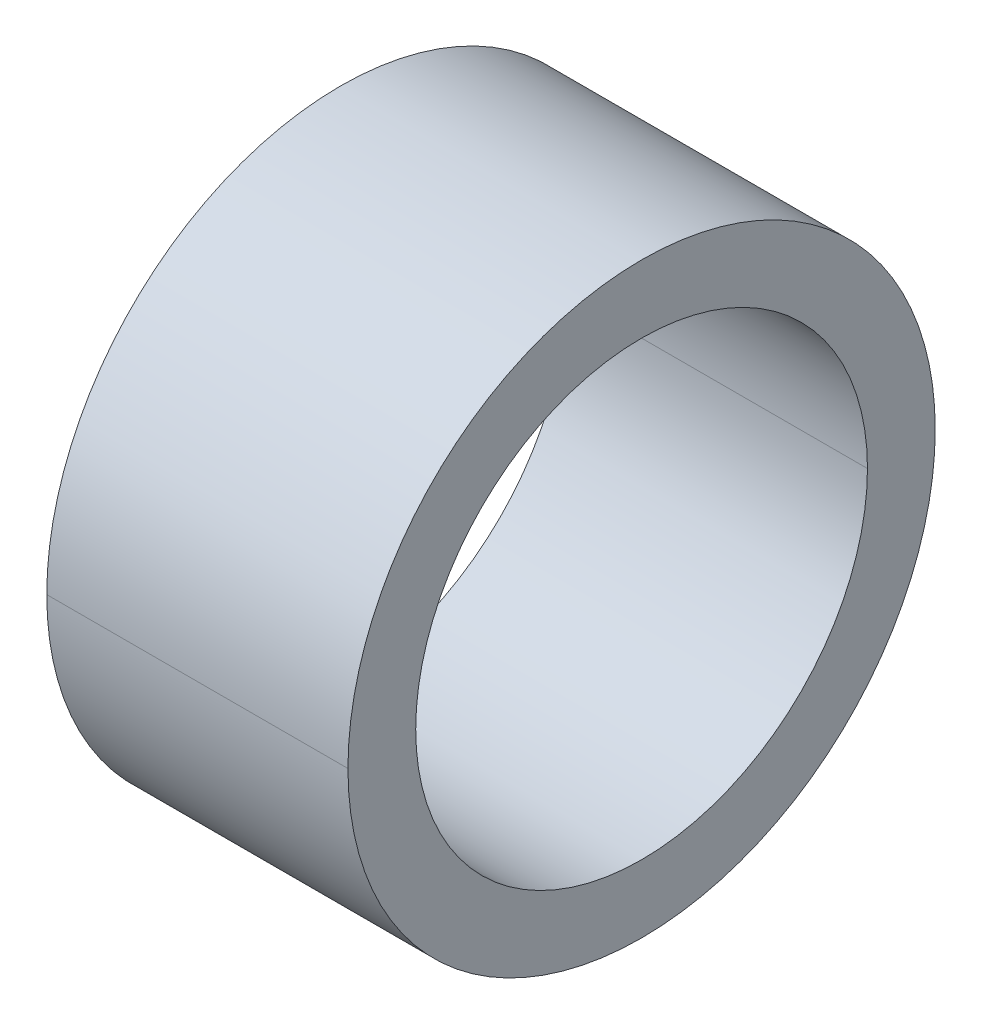
ISO-10303-21;
HEADER;
FILE_DESCRIPTION(('STEP AP214'),'2;1');
FILE_NAME('part.step','',(''),(''),'','','');
FILE_SCHEMA(('AUTOMOTIVE_DESIGN { 1 0 10303 214 1 1 1 1 }'));
ENDSEC;
DATA;
#1=APPLICATION_CONTEXT('core data for automotive mechanical design processes');
#2=APPLICATION_PROTOCOL_DEFINITION('international standard','automotive_design',2000,#1);
#3=PRODUCT_CONTEXT('',#1,'mechanical');
#4=PRODUCT('Part','Part','',(#3));
#5=PRODUCT_RELATED_PRODUCT_CATEGORY('part','',(#4));
#6=PRODUCT_DEFINITION_FORMATION('','',#4);
#7=PRODUCT_DEFINITION_CONTEXT('part definition',#1,'design');
#8=PRODUCT_DEFINITION('design','',#6,#7);
#9=PRODUCT_DEFINITION_SHAPE('','',#8);
#10=(LENGTH_UNIT() NAMED_UNIT(*) SI_UNIT(.MILLI.,.METRE.));
#11=(NAMED_UNIT(*) PLANE_ANGLE_UNIT() SI_UNIT($,.RADIAN.));
#12=(NAMED_UNIT(*) SI_UNIT($,.STERADIAN.) SOLID_ANGLE_UNIT());
#13=UNCERTAINTY_MEASURE_WITH_UNIT(LENGTH_MEASURE(1.E-05),#10,'distance_accuracy_value','');
#14=(GEOMETRIC_REPRESENTATION_CONTEXT(3) GLOBAL_UNCERTAINTY_ASSIGNED_CONTEXT((#13)) GLOBAL_UNIT_ASSIGNED_CONTEXT((#10,
#11,#12)) REPRESENTATION_CONTEXT('',''));
#15=CARTESIAN_POINT('',(0.,0.,0.));
#16=DIRECTION('',(0.,0.,1.));
#17=DIRECTION('',(1.,0.,0.));
#18=AXIS2_PLACEMENT_3D('',#15,#16,#17);
#19=CARTESIAN_POINT('',(0.,9.75,0.));
#20=DIRECTION('',(-1.,0.,0.));
#21=DIRECTION('',(0.,0.,1.));
#22=AXIS2_PLACEMENT_3D('',#19,#20,#21);
#23=PLANE('',#22);
#24=CARTESIAN_POINT('',(0.,0.,0.));
#25=DIRECTION('',(1.,0.,0.));
#26=DIRECTION('',(0.,0.,-1.));
#27=AXIS2_PLACEMENT_3D('',#24,#25,#26);
#28=CIRCLE('',#27,7.5);
#29=CARTESIAN_POINT('',(0.,0.,-7.5));
#30=VERTEX_POINT('',#29);
#31=CARTESIAN_POINT('',(0.,0.,7.5));
#32=VERTEX_POINT('',#31);
#33=EDGE_CURVE('E11',#30,#32,#28,.T.);
#34=ORIENTED_EDGE('',*,*,#33,.T.);
#35=CARTESIAN_POINT('',(0.,0.,0.));
#36=DIRECTION('',(1.,0.,0.));
#37=DIRECTION('',(0.,0.,-1.));
#38=AXIS2_PLACEMENT_3D('',#35,#36,#37);
#39=CIRCLE('',#38,7.5);
#40=EDGE_CURVE('E25',#32,#30,#39,.T.);
#41=ORIENTED_EDGE('',*,*,#40,.T.);
#42=EDGE_LOOP('',(#34,#41));
#43=FACE_BOUND('',#42,.T.);
#44=CARTESIAN_POINT('',(0.,0.,0.));
#45=DIRECTION('',(1.,0.,0.));
#46=DIRECTION('',(0.,0.,-1.));
#47=AXIS2_PLACEMENT_3D('',#44,#45,#46);
#48=CIRCLE('',#47,9.75);
#49=CARTESIAN_POINT('',(0.,0.,9.75));
#50=VERTEX_POINT('',#49);
#51=CARTESIAN_POINT('',(0.,0.,-9.75));
#52=VERTEX_POINT('',#51);
#53=EDGE_CURVE('E95',#50,#52,#48,.T.);
#54=ORIENTED_EDGE('',*,*,#53,.F.);
#55=CARTESIAN_POINT('',(0.,0.,0.));
#56=DIRECTION('',(1.,0.,0.));
#57=DIRECTION('',(0.,0.,-1.));
#58=AXIS2_PLACEMENT_3D('',#55,#56,#57);
#59=CIRCLE('',#58,9.75);
#60=EDGE_CURVE('E90',#52,#50,#59,.T.);
#61=ORIENTED_EDGE('',*,*,#60,.F.);
#62=EDGE_LOOP('',(#54,#61));
#63=FACE_BOUND('',#62,.T.);
#64=ADVANCED_FACE('F17',(#43,#63),#23,.T.);
#65=CARTESIAN_POINT('',(10.,0.,0.));
#66=DIRECTION('',(1.,0.,0.));
#67=DIRECTION('',(0.,-1.,0.));
#68=AXIS2_PLACEMENT_3D('',#65,#66,#67);
#69=CYLINDRICAL_SURFACE('',#68,9.75);
#70=DIRECTION('',(1.,0.,0.));
#71=VECTOR('',#70,1.);
#72=CARTESIAN_POINT('',(0.,0.,9.75));
#73=LINE('',#72,#71);
#74=CARTESIAN_POINT('',(10.,0.,9.75));
#75=VERTEX_POINT('',#74);
#76=EDGE_CURVE('E86',#50,#75,#73,.T.);
#77=ORIENTED_EDGE('',*,*,#76,.T.);
#78=CARTESIAN_POINT('',(10.,0.,0.));
#79=DIRECTION('',(1.,0.,0.));
#80=DIRECTION('',(0.,0.,-1.));
#81=AXIS2_PLACEMENT_3D('',#78,#79,#80);
#82=CIRCLE('',#81,9.75);
#83=CARTESIAN_POINT('',(10.,0.,-9.75));
#84=VERTEX_POINT('',#83);
#85=EDGE_CURVE('E81',#84,#75,#82,.T.);
#86=ORIENTED_EDGE('',*,*,#85,.F.);
#87=DIRECTION('',(1.,0.,0.));
#88=VECTOR('',#87,1.);
#89=CARTESIAN_POINT('',(0.,0.,-9.75));
#90=LINE('',#89,#88);
#91=EDGE_CURVE('E70',#52,#84,#90,.T.);
#92=ORIENTED_EDGE('',*,*,#91,.F.);
#93=ORIENTED_EDGE('',*,*,#60,.T.);
#94=EDGE_LOOP('',(#77,#86,#92,#93));
#95=FACE_BOUND('',#94,.T.);
#96=ADVANCED_FACE('F111',(#95),#69,.T.);
#97=CARTESIAN_POINT('',(10.,0.,0.));
#98=DIRECTION('',(1.,0.,0.));
#99=DIRECTION('',(0.,1.,0.));
#100=AXIS2_PLACEMENT_3D('',#97,#98,#99);
#101=CYLINDRICAL_SURFACE('',#100,9.75);
#102=ORIENTED_EDGE('',*,*,#76,.F.);
#103=ORIENTED_EDGE('',*,*,#53,.T.);
#104=ORIENTED_EDGE('',*,*,#91,.T.);
#105=CARTESIAN_POINT('',(10.,0.,0.));
#106=DIRECTION('',(1.,0.,0.));
#107=DIRECTION('',(0.,0.,-1.));
#108=AXIS2_PLACEMENT_3D('',#105,#106,#107);
#109=CIRCLE('',#108,9.75);
#110=EDGE_CURVE('E67',#75,#84,#109,.T.);
#111=ORIENTED_EDGE('',*,*,#110,.F.);
#112=EDGE_LOOP('',(#102,#103,#104,#111));
#113=FACE_BOUND('',#112,.T.);
#114=ADVANCED_FACE('F106',(#113),#101,.T.);
#115=CARTESIAN_POINT('',(10.,7.5,0.));
#116=DIRECTION('',(1.,0.,0.));
#117=DIRECTION('',(0.,0.,-1.));
#118=AXIS2_PLACEMENT_3D('',#115,#116,#117);
#119=PLANE('',#118);
#120=ORIENTED_EDGE('',*,*,#85,.T.);
#121=ORIENTED_EDGE('',*,*,#110,.T.);
#122=EDGE_LOOP('',(#120,#121));
#123=FACE_BOUND('',#122,.T.);
#124=CARTESIAN_POINT('',(10.,0.,0.));
#125=DIRECTION('',(1.,0.,0.));
#126=DIRECTION('',(0.,0.,-1.));
#127=AXIS2_PLACEMENT_3D('',#124,#125,#126);
#128=CIRCLE('',#127,7.5);
#129=CARTESIAN_POINT('',(10.,0.,7.5));
#130=VERTEX_POINT('',#129);
#131=CARTESIAN_POINT('',(10.,0.,-7.5));
#132=VERTEX_POINT('',#131);
#133=EDGE_CURVE('E55',#130,#132,#128,.T.);
#134=ORIENTED_EDGE('',*,*,#133,.F.);
#135=CARTESIAN_POINT('',(10.,0.,0.));
#136=DIRECTION('',(1.,0.,0.));
#137=DIRECTION('',(0.,0.,-1.));
#138=AXIS2_PLACEMENT_3D('',#135,#136,#137);
#139=CIRCLE('',#138,7.5);
#140=EDGE_CURVE('E51',#132,#130,#139,.T.);
#141=ORIENTED_EDGE('',*,*,#140,.F.);
#142=EDGE_LOOP('',(#134,#141));
#143=FACE_BOUND('',#142,.T.);
#144=ADVANCED_FACE('F53',(#123,#143),#119,.T.);
#145=CARTESIAN_POINT('',(10.,0.,0.));
#146=DIRECTION('',(1.,0.,0.));
#147=DIRECTION('',(0.,-1.,0.));
#148=AXIS2_PLACEMENT_3D('',#145,#146,#147);
#149=CYLINDRICAL_SURFACE('',#148,7.5);
#150=DIRECTION('',(1.,0.,0.));
#151=VECTOR('',#150,1.);
#152=CARTESIAN_POINT('',(0.,0.,7.5));
#153=LINE('',#152,#151);
#154=EDGE_CURVE('E59',#32,#130,#153,.T.);
#155=ORIENTED_EDGE('',*,*,#154,.F.);
#156=ORIENTED_EDGE('',*,*,#33,.F.);
#157=DIRECTION('',(1.,0.,0.));
#158=VECTOR('',#157,1.);
#159=CARTESIAN_POINT('',(0.,0.,-7.5));
#160=LINE('',#159,#158);
#161=EDGE_CURVE('E62',#30,#132,#160,.T.);
#162=ORIENTED_EDGE('',*,*,#161,.T.);
#163=ORIENTED_EDGE('',*,*,#140,.T.);
#164=EDGE_LOOP('',(#155,#156,#162,#163));
#165=FACE_BOUND('',#164,.T.);
#166=ADVANCED_FACE('F63',(#165),#149,.F.);
#167=CARTESIAN_POINT('',(10.,0.,0.));
#168=DIRECTION('',(1.,0.,0.));
#169=DIRECTION('',(0.,1.,0.));
#170=AXIS2_PLACEMENT_3D('',#167,#168,#169);
#171=CYLINDRICAL_SURFACE('',#170,7.5);
#172=ORIENTED_EDGE('',*,*,#154,.T.);
#173=ORIENTED_EDGE('',*,*,#133,.T.);
#174=ORIENTED_EDGE('',*,*,#161,.F.);
#175=ORIENTED_EDGE('',*,*,#40,.F.);
#176=EDGE_LOOP('',(#172,#173,#174,#175));
#177=FACE_BOUND('',#176,.T.);
#178=ADVANCED_FACE('F66',(#177),#171,.F.);
#179=CLOSED_SHELL('',(#64,#96,#114,#144,#166,#178));
#180=MANIFOLD_SOLID_BREP('B1',#179);
#181=ADVANCED_BREP_SHAPE_REPRESENTATION('',(#18,#180),#14);
#182=SHAPE_DEFINITION_REPRESENTATION(#9,#181);
ENDSEC;
END-ISO-10303-21;
